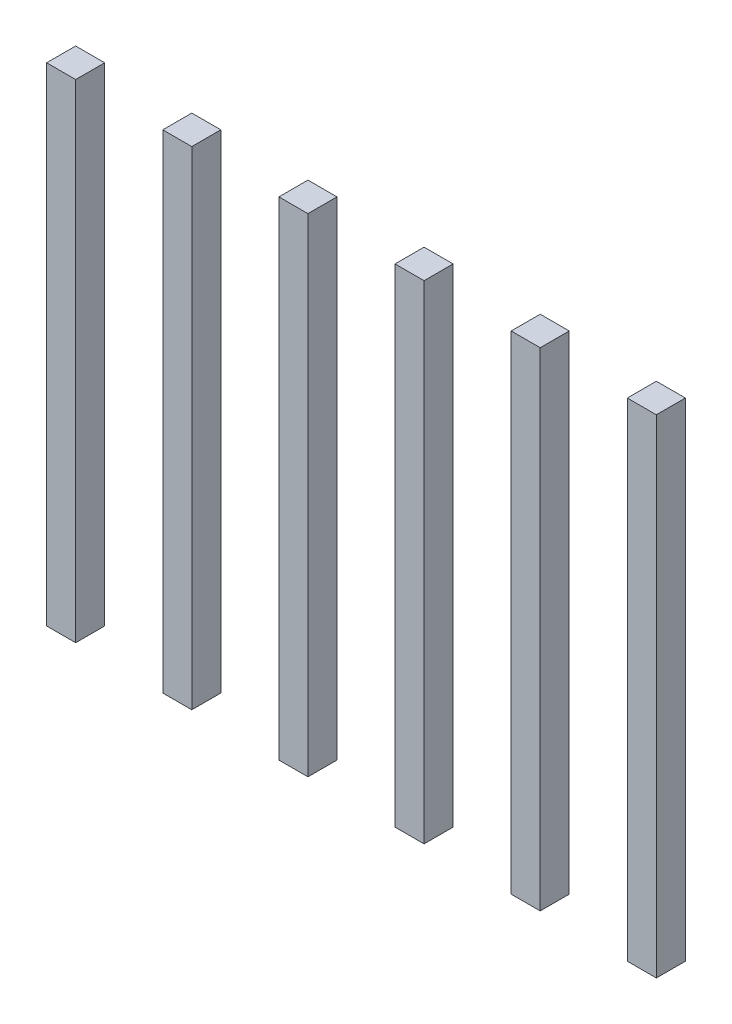
ISO-10303-21;
HEADER;
FILE_DESCRIPTION(('STEP AP214'),'2;1');
FILE_NAME('part.step','',(''),(''),'','','');
FILE_SCHEMA(('AUTOMOTIVE_DESIGN { 1 0 10303 214 1 1 1 1 }'));
ENDSEC;
DATA;
#1=APPLICATION_CONTEXT('core data for automotive mechanical design processes');
#2=APPLICATION_PROTOCOL_DEFINITION('international standard','automotive_design',2000,#1);
#3=PRODUCT_CONTEXT('',#1,'mechanical');
#4=PRODUCT('Part','Part','',(#3));
#5=PRODUCT_RELATED_PRODUCT_CATEGORY('part','',(#4));
#6=PRODUCT_DEFINITION_FORMATION('','',#4);
#7=PRODUCT_DEFINITION_CONTEXT('part definition',#1,'design');
#8=PRODUCT_DEFINITION('design','',#6,#7);
#9=PRODUCT_DEFINITION_SHAPE('','',#8);
#10=(LENGTH_UNIT() NAMED_UNIT(*) SI_UNIT(.MILLI.,.METRE.));
#11=(NAMED_UNIT(*) PLANE_ANGLE_UNIT() SI_UNIT($,.RADIAN.));
#12=(NAMED_UNIT(*) SI_UNIT($,.STERADIAN.) SOLID_ANGLE_UNIT());
#13=UNCERTAINTY_MEASURE_WITH_UNIT(LENGTH_MEASURE(1.E-05),#10,'distance_accuracy_value','');
#14=(GEOMETRIC_REPRESENTATION_CONTEXT(3) GLOBAL_UNCERTAINTY_ASSIGNED_CONTEXT((#13)) GLOBAL_UNIT_ASSIGNED_CONTEXT((#10,
#11,#12)) REPRESENTATION_CONTEXT('',''));
#15=CARTESIAN_POINT('',(0.,0.,0.));
#16=DIRECTION('',(0.,0.,1.));
#17=DIRECTION('',(1.,0.,0.));
#18=AXIS2_PLACEMENT_3D('',#15,#16,#17);
#19=CARTESIAN_POINT('',(10.,5.,-1.8));
#20=DIRECTION('',(0.,1.,0.));
#21=DIRECTION('',(1.,0.,0.));
#22=AXIS2_PLACEMENT_3D('',#19,#20,#21);
#23=PLANE('',#22);
#24=DIRECTION('',(0.,0.,1.));
#25=VECTOR('',#24,1.);
#26=CARTESIAN_POINT('',(9.75,5.,-1.55));
#27=LINE('',#26,#25);
#28=CARTESIAN_POINT('',(9.75,5.,-2.05));
#29=VERTEX_POINT('',#28);
#30=CARTESIAN_POINT('',(9.75,5.,-1.55));
#31=VERTEX_POINT('',#30);
#32=EDGE_CURVE('P0_E11',#29,#31,#27,.T.);
#33=ORIENTED_EDGE('',*,*,#32,.T.);
#34=DIRECTION('',(1.,0.,0.));
#35=VECTOR('',#34,1.);
#36=CARTESIAN_POINT('',(10.25,5.,-1.55));
#37=LINE('',#36,#35);
#38=CARTESIAN_POINT('',(10.25,5.,-1.55));
#39=VERTEX_POINT('',#38);
#40=EDGE_CURVE('P0_E114',#31,#39,#37,.T.);
#41=ORIENTED_EDGE('',*,*,#40,.T.);
#42=DIRECTION('',(0.,0.,-1.));
#43=VECTOR('',#42,1.);
#44=CARTESIAN_POINT('',(10.25,5.,-2.05));
#45=LINE('',#44,#43);
#46=CARTESIAN_POINT('',(10.25,5.,-2.05));
#47=VERTEX_POINT('',#46);
#48=EDGE_CURVE('P0_E102',#39,#47,#45,.T.);
#49=ORIENTED_EDGE('',*,*,#48,.T.);
#50=DIRECTION('',(-1.,0.,0.));
#51=VECTOR('',#50,1.);
#52=CARTESIAN_POINT('',(9.75,5.,-2.05));
#53=LINE('',#52,#51);
#54=EDGE_CURVE('P0_E20',#47,#29,#53,.T.);
#55=ORIENTED_EDGE('',*,*,#54,.T.);
#56=EDGE_LOOP('',(#33,#41,#49,#55));
#57=FACE_BOUND('',#56,.T.);
#58=ADVANCED_FACE('P0_F16',(#57),#23,.T.);
#59=CARTESIAN_POINT('',(9.75,0.,-2.05));
#60=DIRECTION('',(-1.,0.,0.));
#61=DIRECTION('',(0.,0.,1.));
#62=AXIS2_PLACEMENT_3D('',#59,#60,#61);
#63=PLANE('',#62);
#64=DIRECTION('',(0.,1.,0.));
#65=VECTOR('',#64,1.);
#66=CARTESIAN_POINT('',(9.75,0.,-1.55));
#67=LINE('',#66,#65);
#68=CARTESIAN_POINT('',(9.75,-3.4,-1.55));
#69=VERTEX_POINT('',#68);
#70=EDGE_CURVE('P0_E27',#69,#31,#67,.T.);
#71=ORIENTED_EDGE('',*,*,#70,.T.);
#72=ORIENTED_EDGE('',*,*,#32,.F.);
#73=DIRECTION('',(0.,-1.,0.));
#74=VECTOR('',#73,1.);
#75=CARTESIAN_POINT('',(9.75,0.,-2.05));
#76=LINE('',#75,#74);
#77=CARTESIAN_POINT('',(9.75,-3.4,-2.05));
#78=VERTEX_POINT('',#77);
#79=EDGE_CURVE('P0_E72',#29,#78,#76,.T.);
#80=ORIENTED_EDGE('',*,*,#79,.T.);
#81=DIRECTION('',(0.,0.,-1.));
#82=VECTOR('',#81,1.);
#83=CARTESIAN_POINT('',(9.75,-3.4,-1.55));
#84=LINE('',#83,#82);
#85=EDGE_CURVE('P0_E76',#69,#78,#84,.T.);
#86=ORIENTED_EDGE('',*,*,#85,.F.);
#87=EDGE_LOOP('',(#71,#72,#80,#86));
#88=FACE_BOUND('',#87,.T.);
#89=ADVANCED_FACE('P0_F74',(#88),#63,.T.);
#90=CARTESIAN_POINT('',(9.75,0.,-1.55));
#91=DIRECTION('',(0.,0.,1.));
#92=DIRECTION('',(1.,0.,0.));
#93=AXIS2_PLACEMENT_3D('',#90,#91,#92);
#94=PLANE('',#93);
#95=DIRECTION('',(0.,1.,0.));
#96=VECTOR('',#95,1.);
#97=CARTESIAN_POINT('',(10.25,0.,-1.55));
#98=LINE('',#97,#96);
#99=CARTESIAN_POINT('',(10.25,-3.4,-1.55));
#100=VERTEX_POINT('',#99);
#101=EDGE_CURVE('P0_E115',#100,#39,#98,.T.);
#102=ORIENTED_EDGE('',*,*,#101,.T.);
#103=ORIENTED_EDGE('',*,*,#40,.F.);
#104=ORIENTED_EDGE('',*,*,#70,.F.);
#105=DIRECTION('',(-1.,0.,0.));
#106=VECTOR('',#105,1.);
#107=CARTESIAN_POINT('',(10.25,-3.4,-1.55));
#108=LINE('',#107,#106);
#109=EDGE_CURVE('P0_E80',#100,#69,#108,.T.);
#110=ORIENTED_EDGE('',*,*,#109,.F.);
#111=EDGE_LOOP('',(#102,#103,#104,#110));
#112=FACE_BOUND('',#111,.T.);
#113=ADVANCED_FACE('P0_F18',(#112),#94,.T.);
#114=CARTESIAN_POINT('',(10.25,0.,-1.55));
#115=DIRECTION('',(1.,0.,0.));
#116=DIRECTION('',(0.,1.,0.));
#117=AXIS2_PLACEMENT_3D('',#114,#115,#116);
#118=PLANE('',#117);
#119=DIRECTION('',(0.,1.,0.));
#120=VECTOR('',#119,1.);
#121=CARTESIAN_POINT('',(10.25,0.,-2.05));
#122=LINE('',#121,#120);
#123=CARTESIAN_POINT('',(10.25,-3.4,-2.05));
#124=VERTEX_POINT('',#123);
#125=EDGE_CURVE('P0_E86',#124,#47,#122,.T.);
#126=ORIENTED_EDGE('',*,*,#125,.T.);
#127=ORIENTED_EDGE('',*,*,#48,.F.);
#128=ORIENTED_EDGE('',*,*,#101,.F.);
#129=DIRECTION('',(0.,0.,1.));
#130=VECTOR('',#129,1.);
#131=CARTESIAN_POINT('',(10.25,-3.4,-2.05));
#132=LINE('',#131,#130);
#133=EDGE_CURVE('P0_E91',#124,#100,#132,.T.);
#134=ORIENTED_EDGE('',*,*,#133,.F.);
#135=EDGE_LOOP('',(#126,#127,#128,#134));
#136=FACE_BOUND('',#135,.T.);
#137=ADVANCED_FACE('P0_F126',(#136),#118,.T.);
#138=CARTESIAN_POINT('',(10.25,0.,-2.05));
#139=DIRECTION('',(0.,0.,-1.));
#140=DIRECTION('',(0.,-1.,0.));
#141=AXIS2_PLACEMENT_3D('',#138,#139,#140);
#142=PLANE('',#141);
#143=ORIENTED_EDGE('',*,*,#79,.F.);
#144=ORIENTED_EDGE('',*,*,#54,.F.);
#145=ORIENTED_EDGE('',*,*,#125,.F.);
#146=DIRECTION('',(1.,0.,0.));
#147=VECTOR('',#146,1.);
#148=CARTESIAN_POINT('',(9.75,-3.4,-2.05));
#149=LINE('',#148,#147);
#150=EDGE_CURVE('P0_E83',#78,#124,#149,.T.);
#151=ORIENTED_EDGE('',*,*,#150,.F.);
#152=EDGE_LOOP('',(#143,#144,#145,#151));
#153=FACE_BOUND('',#152,.T.);
#154=ADVANCED_FACE('P0_F84',(#153),#142,.T.);
#155=CARTESIAN_POINT('',(10.,-3.4,-1.8));
#156=DIRECTION('',(0.,-1.,0.));
#157=DIRECTION('',(0.,0.,-1.));
#158=AXIS2_PLACEMENT_3D('',#155,#156,#157);
#159=PLANE('',#158);
#160=ORIENTED_EDGE('',*,*,#85,.T.);
#161=ORIENTED_EDGE('',*,*,#150,.T.);
#162=ORIENTED_EDGE('',*,*,#133,.T.);
#163=ORIENTED_EDGE('',*,*,#109,.T.);
#164=EDGE_LOOP('',(#160,#161,#162,#163));
#165=FACE_BOUND('',#164,.T.);
#166=ADVANCED_FACE('P0_F93',(#165),#159,.T.);
#167=CLOSED_SHELL('',(#58,#89,#113,#137,#154,#166));
#168=MANIFOLD_SOLID_BREP('P0_B1',#167);
#169=CARTESIAN_POINT('',(2.,5.,-1.8));
#170=DIRECTION('',(0.,1.,0.));
#171=DIRECTION('',(1.,0.,0.));
#172=AXIS2_PLACEMENT_3D('',#169,#170,#171);
#173=PLANE('',#172);
#174=DIRECTION('',(-1.,0.,0.));
#175=VECTOR('',#174,1.);
#176=CARTESIAN_POINT('',(1.75,5.,-2.05));
#177=LINE('',#176,#175);
#178=CARTESIAN_POINT('',(2.25,5.,-2.05));
#179=VERTEX_POINT('',#178);
#180=CARTESIAN_POINT('',(1.75,5.,-2.05));
#181=VERTEX_POINT('',#180);
#182=EDGE_CURVE('P1_E11',#179,#181,#177,.T.);
#183=ORIENTED_EDGE('',*,*,#182,.T.);
#184=DIRECTION('',(0.,0.,1.));
#185=VECTOR('',#184,1.);
#186=CARTESIAN_POINT('',(1.75,5.,-1.55));
#187=LINE('',#186,#185);
#188=CARTESIAN_POINT('',(1.75,5.,-1.55));
#189=VERTEX_POINT('',#188);
#190=EDGE_CURVE('P1_E78',#181,#189,#187,.T.);
#191=ORIENTED_EDGE('',*,*,#190,.T.);
#192=DIRECTION('',(1.,0.,0.));
#193=VECTOR('',#192,1.);
#194=CARTESIAN_POINT('',(2.25,5.,-1.55));
#195=LINE('',#194,#193);
#196=CARTESIAN_POINT('',(2.25,5.,-1.55));
#197=VERTEX_POINT('',#196);
#198=EDGE_CURVE('P1_E74',#189,#197,#195,.T.);
#199=ORIENTED_EDGE('',*,*,#198,.T.);
#200=DIRECTION('',(0.,0.,-1.));
#201=VECTOR('',#200,1.);
#202=CARTESIAN_POINT('',(2.25,5.,-2.05));
#203=LINE('',#202,#201);
#204=EDGE_CURVE('P1_E107',#197,#179,#203,.T.);
#205=ORIENTED_EDGE('',*,*,#204,.T.);
#206=EDGE_LOOP('',(#183,#191,#199,#205));
#207=FACE_BOUND('',#206,.T.);
#208=ADVANCED_FACE('P1_F16',(#207),#173,.T.);
#209=CARTESIAN_POINT('',(2.25,0.,-2.05));
#210=DIRECTION('',(0.,0.,-1.));
#211=DIRECTION('',(0.,-1.,0.));
#212=AXIS2_PLACEMENT_3D('',#209,#210,#211);
#213=PLANE('',#212);
#214=DIRECTION('',(0.,1.,0.));
#215=VECTOR('',#214,1.);
#216=CARTESIAN_POINT('',(1.75,0.,-2.05));
#217=LINE('',#216,#215);
#218=CARTESIAN_POINT('',(1.75,-3.4,-2.05));
#219=VERTEX_POINT('',#218);
#220=EDGE_CURVE('P1_E20',#219,#181,#217,.T.);
#221=ORIENTED_EDGE('',*,*,#220,.T.);
#222=ORIENTED_EDGE('',*,*,#182,.F.);
#223=DIRECTION('',(0.,-1.,0.));
#224=VECTOR('',#223,1.);
#225=CARTESIAN_POINT('',(2.25,0.,-2.05));
#226=LINE('',#225,#224);
#227=CARTESIAN_POINT('',(2.25,-3.4,-2.05));
#228=VERTEX_POINT('',#227);
#229=EDGE_CURVE('P1_E87',#179,#228,#226,.T.);
#230=ORIENTED_EDGE('',*,*,#229,.T.);
#231=DIRECTION('',(1.,0.,0.));
#232=VECTOR('',#231,1.);
#233=CARTESIAN_POINT('',(1.75,-3.4,-2.05));
#234=LINE('',#233,#232);
#235=EDGE_CURVE('P1_E98',#219,#228,#234,.T.);
#236=ORIENTED_EDGE('',*,*,#235,.F.);
#237=EDGE_LOOP('',(#221,#222,#230,#236));
#238=FACE_BOUND('',#237,.T.);
#239=ADVANCED_FACE('P1_F18',(#238),#213,.T.);
#240=CARTESIAN_POINT('',(1.75,0.,-2.05));
#241=DIRECTION('',(-1.,0.,0.));
#242=DIRECTION('',(0.,0.,1.));
#243=AXIS2_PLACEMENT_3D('',#240,#241,#242);
#244=PLANE('',#243);
#245=DIRECTION('',(0.,1.,0.));
#246=VECTOR('',#245,1.);
#247=CARTESIAN_POINT('',(1.75,0.,-1.55));
#248=LINE('',#247,#246);
#249=CARTESIAN_POINT('',(1.75,-3.4,-1.55));
#250=VERTEX_POINT('',#249);
#251=EDGE_CURVE('P1_E67',#250,#189,#248,.T.);
#252=ORIENTED_EDGE('',*,*,#251,.T.);
#253=ORIENTED_EDGE('',*,*,#190,.F.);
#254=ORIENTED_EDGE('',*,*,#220,.F.);
#255=DIRECTION('',(0.,0.,-1.));
#256=VECTOR('',#255,1.);
#257=CARTESIAN_POINT('',(1.75,-3.4,-1.55));
#258=LINE('',#257,#256);
#259=EDGE_CURVE('P1_E81',#250,#219,#258,.T.);
#260=ORIENTED_EDGE('',*,*,#259,.F.);
#261=EDGE_LOOP('',(#252,#253,#254,#260));
#262=FACE_BOUND('',#261,.T.);
#263=ADVANCED_FACE('P1_F82',(#262),#244,.T.);
#264=CARTESIAN_POINT('',(1.75,0.,-1.55));
#265=DIRECTION('',(0.,0.,1.));
#266=DIRECTION('',(1.,0.,0.));
#267=AXIS2_PLACEMENT_3D('',#264,#265,#266);
#268=PLANE('',#267);
#269=DIRECTION('',(0.,1.,0.));
#270=VECTOR('',#269,1.);
#271=CARTESIAN_POINT('',(2.25,0.,-1.55));
#272=LINE('',#271,#270);
#273=CARTESIAN_POINT('',(2.25,-3.4,-1.55));
#274=VERTEX_POINT('',#273);
#275=EDGE_CURVE('P1_E104',#274,#197,#272,.T.);
#276=ORIENTED_EDGE('',*,*,#275,.T.);
#277=ORIENTED_EDGE('',*,*,#198,.F.);
#278=ORIENTED_EDGE('',*,*,#251,.F.);
#279=DIRECTION('',(-1.,0.,0.));
#280=VECTOR('',#279,1.);
#281=CARTESIAN_POINT('',(2.25,-3.4,-1.55));
#282=LINE('',#281,#280);
#283=EDGE_CURVE('P1_E72',#274,#250,#282,.T.);
#284=ORIENTED_EDGE('',*,*,#283,.F.);
#285=EDGE_LOOP('',(#276,#277,#278,#284));
#286=FACE_BOUND('',#285,.T.);
#287=ADVANCED_FACE('P1_F70',(#286),#268,.T.);
#288=CARTESIAN_POINT('',(2.25,0.,-1.55));
#289=DIRECTION('',(1.,0.,0.));
#290=DIRECTION('',(0.,1.,0.));
#291=AXIS2_PLACEMENT_3D('',#288,#289,#290);
#292=PLANE('',#291);
#293=ORIENTED_EDGE('',*,*,#229,.F.);
#294=ORIENTED_EDGE('',*,*,#204,.F.);
#295=ORIENTED_EDGE('',*,*,#275,.F.);
#296=DIRECTION('',(0.,0.,1.));
#297=VECTOR('',#296,1.);
#298=CARTESIAN_POINT('',(2.25,-3.4,-2.05));
#299=LINE('',#298,#297);
#300=EDGE_CURVE('P1_E91',#228,#274,#299,.T.);
#301=ORIENTED_EDGE('',*,*,#300,.F.);
#302=EDGE_LOOP('',(#293,#294,#295,#301));
#303=FACE_BOUND('',#302,.T.);
#304=ADVANCED_FACE('P1_F116',(#303),#292,.T.);
#305=CARTESIAN_POINT('',(2.,-3.4,-1.8));
#306=DIRECTION('',(0.,-1.,0.));
#307=DIRECTION('',(0.,0.,-1.));
#308=AXIS2_PLACEMENT_3D('',#305,#306,#307);
#309=PLANE('',#308);
#310=ORIENTED_EDGE('',*,*,#235,.T.);
#311=ORIENTED_EDGE('',*,*,#300,.T.);
#312=ORIENTED_EDGE('',*,*,#283,.T.);
#313=ORIENTED_EDGE('',*,*,#259,.T.);
#314=EDGE_LOOP('',(#310,#311,#312,#313));
#315=FACE_BOUND('',#314,.T.);
#316=ADVANCED_FACE('P1_F89',(#315),#309,.T.);
#317=CLOSED_SHELL('',(#208,#239,#263,#287,#304,#316));
#318=MANIFOLD_SOLID_BREP('P1_B1',#317);
#319=CARTESIAN_POINT('',(8.,5.,-1.8));
#320=DIRECTION('',(0.,1.,0.));
#321=DIRECTION('',(1.,0.,0.));
#322=AXIS2_PLACEMENT_3D('',#319,#320,#321);
#323=PLANE('',#322);
#324=DIRECTION('',(0.,0.,1.));
#325=VECTOR('',#324,1.);
#326=CARTESIAN_POINT('',(7.75,5.,-1.55));
#327=LINE('',#326,#325);
#328=CARTESIAN_POINT('',(7.75,5.,-2.05));
#329=VERTEX_POINT('',#328);
#330=CARTESIAN_POINT('',(7.75,5.,-1.55));
#331=VERTEX_POINT('',#330);
#332=EDGE_CURVE('P2_E11',#329,#331,#327,.T.);
#333=ORIENTED_EDGE('',*,*,#332,.T.);
#334=DIRECTION('',(1.,0.,0.));
#335=VECTOR('',#334,1.);
#336=CARTESIAN_POINT('',(8.25,5.,-1.55));
#337=LINE('',#336,#335);
#338=CARTESIAN_POINT('',(8.25,5.,-1.55));
#339=VERTEX_POINT('',#338);
#340=EDGE_CURVE('P2_E79',#331,#339,#337,.T.);
#341=ORIENTED_EDGE('',*,*,#340,.T.);
#342=DIRECTION('',(0.,0.,-1.));
#343=VECTOR('',#342,1.);
#344=CARTESIAN_POINT('',(8.25,5.,-2.05));
#345=LINE('',#344,#343);
#346=CARTESIAN_POINT('',(8.25,5.,-2.05));
#347=VERTEX_POINT('',#346);
#348=EDGE_CURVE('P2_E75',#339,#347,#345,.T.);
#349=ORIENTED_EDGE('',*,*,#348,.T.);
#350=DIRECTION('',(-1.,0.,0.));
#351=VECTOR('',#350,1.);
#352=CARTESIAN_POINT('',(7.75,5.,-2.05));
#353=LINE('',#352,#351);
#354=EDGE_CURVE('P2_E76',#347,#329,#353,.T.);
#355=ORIENTED_EDGE('',*,*,#354,.T.);
#356=EDGE_LOOP('',(#333,#341,#349,#355));
#357=FACE_BOUND('',#356,.T.);
#358=ADVANCED_FACE('P2_F16',(#357),#323,.T.);
#359=CARTESIAN_POINT('',(7.75,0.,-2.05));
#360=DIRECTION('',(-1.,0.,0.));
#361=DIRECTION('',(0.,0.,1.));
#362=AXIS2_PLACEMENT_3D('',#359,#360,#361);
#363=PLANE('',#362);
#364=DIRECTION('',(0.,1.,0.));
#365=VECTOR('',#364,1.);
#366=CARTESIAN_POINT('',(7.75,0.,-1.55));
#367=LINE('',#366,#365);
#368=CARTESIAN_POINT('',(7.75,-3.4,-1.55));
#369=VERTEX_POINT('',#368);
#370=EDGE_CURVE('P2_E26',#369,#331,#367,.T.);
#371=ORIENTED_EDGE('',*,*,#370,.T.);
#372=ORIENTED_EDGE('',*,*,#332,.F.);
#373=DIRECTION('',(0.,-1.,0.));
#374=VECTOR('',#373,1.);
#375=CARTESIAN_POINT('',(7.75,0.,-2.05));
#376=LINE('',#375,#374);
#377=CARTESIAN_POINT('',(7.75,-3.4,-2.05));
#378=VERTEX_POINT('',#377);
#379=EDGE_CURVE('P2_E89',#329,#378,#376,.T.);
#380=ORIENTED_EDGE('',*,*,#379,.T.);
#381=DIRECTION('',(0.,0.,-1.));
#382=VECTOR('',#381,1.);
#383=CARTESIAN_POINT('',(7.75,-3.4,-1.55));
#384=LINE('',#383,#382);
#385=EDGE_CURVE('P2_E105',#369,#378,#384,.T.);
#386=ORIENTED_EDGE('',*,*,#385,.F.);
#387=EDGE_LOOP('',(#371,#372,#380,#386));
#388=FACE_BOUND('',#387,.T.);
#389=ADVANCED_FACE('P2_F114',(#388),#363,.T.);
#390=CARTESIAN_POINT('',(7.75,0.,-1.55));
#391=DIRECTION('',(0.,0.,1.));
#392=DIRECTION('',(1.,0.,0.));
#393=AXIS2_PLACEMENT_3D('',#390,#391,#392);
#394=PLANE('',#393);
#395=DIRECTION('',(0.,1.,0.));
#396=VECTOR('',#395,1.);
#397=CARTESIAN_POINT('',(8.25,0.,-1.55));
#398=LINE('',#397,#396);
#399=CARTESIAN_POINT('',(8.25,-3.4,-1.55));
#400=VERTEX_POINT('',#399);
#401=EDGE_CURVE('P2_E19',#400,#339,#398,.T.);
#402=ORIENTED_EDGE('',*,*,#401,.T.);
#403=ORIENTED_EDGE('',*,*,#340,.F.);
#404=ORIENTED_EDGE('',*,*,#370,.F.);
#405=DIRECTION('',(-1.,0.,0.));
#406=VECTOR('',#405,1.);
#407=CARTESIAN_POINT('',(8.25,-3.4,-1.55));
#408=LINE('',#407,#406);
#409=EDGE_CURVE('P2_E96',#400,#369,#408,.T.);
#410=ORIENTED_EDGE('',*,*,#409,.F.);
#411=EDGE_LOOP('',(#402,#403,#404,#410));
#412=FACE_BOUND('',#411,.T.);
#413=ADVANCED_FACE('P2_F116',(#412),#394,.T.);
#414=CARTESIAN_POINT('',(8.25,0.,-1.55));
#415=DIRECTION('',(1.,0.,0.));
#416=DIRECTION('',(0.,1.,0.));
#417=AXIS2_PLACEMENT_3D('',#414,#415,#416);
#418=PLANE('',#417);
#419=DIRECTION('',(0.,1.,0.));
#420=VECTOR('',#419,1.);
#421=CARTESIAN_POINT('',(8.25,0.,-2.05));
#422=LINE('',#421,#420);
#423=CARTESIAN_POINT('',(8.25,-3.4,-2.05));
#424=VERTEX_POINT('',#423);
#425=EDGE_CURVE('P2_E57',#424,#347,#422,.T.);
#426=ORIENTED_EDGE('',*,*,#425,.T.);
#427=ORIENTED_EDGE('',*,*,#348,.F.);
#428=ORIENTED_EDGE('',*,*,#401,.F.);
#429=DIRECTION('',(0.,0.,1.));
#430=VECTOR('',#429,1.);
#431=CARTESIAN_POINT('',(8.25,-3.4,-2.05));
#432=LINE('',#431,#430);
#433=EDGE_CURVE('P2_E84',#424,#400,#432,.T.);
#434=ORIENTED_EDGE('',*,*,#433,.F.);
#435=EDGE_LOOP('',(#426,#427,#428,#434));
#436=FACE_BOUND('',#435,.T.);
#437=ADVANCED_FACE('P2_F82',(#436),#418,.T.);
#438=CARTESIAN_POINT('',(8.25,0.,-2.05));
#439=DIRECTION('',(0.,0.,-1.));
#440=DIRECTION('',(0.,-1.,0.));
#441=AXIS2_PLACEMENT_3D('',#438,#439,#440);
#442=PLANE('',#441);
#443=ORIENTED_EDGE('',*,*,#379,.F.);
#444=ORIENTED_EDGE('',*,*,#354,.F.);
#445=ORIENTED_EDGE('',*,*,#425,.F.);
#446=DIRECTION('',(1.,0.,0.));
#447=VECTOR('',#446,1.);
#448=CARTESIAN_POINT('',(7.75,-3.4,-2.05));
#449=LINE('',#448,#447);
#450=EDGE_CURVE('P2_E108',#378,#424,#449,.T.);
#451=ORIENTED_EDGE('',*,*,#450,.F.);
#452=EDGE_LOOP('',(#443,#444,#445,#451));
#453=FACE_BOUND('',#452,.T.);
#454=ADVANCED_FACE('P2_F88',(#453),#442,.T.);
#455=CARTESIAN_POINT('',(8.,-3.4,-1.8));
#456=DIRECTION('',(0.,-1.,0.));
#457=DIRECTION('',(0.,0.,-1.));
#458=AXIS2_PLACEMENT_3D('',#455,#456,#457);
#459=PLANE('',#458);
#460=ORIENTED_EDGE('',*,*,#385,.T.);
#461=ORIENTED_EDGE('',*,*,#450,.T.);
#462=ORIENTED_EDGE('',*,*,#433,.T.);
#463=ORIENTED_EDGE('',*,*,#409,.T.);
#464=EDGE_LOOP('',(#460,#461,#462,#463));
#465=FACE_BOUND('',#464,.T.);
#466=ADVANCED_FACE('P2_F154',(#465),#459,.T.);
#467=CLOSED_SHELL('',(#358,#389,#413,#437,#454,#466));
#468=MANIFOLD_SOLID_BREP('P2_B1',#467);
#469=CARTESIAN_POINT('',(12.,5.,-1.8));
#470=DIRECTION('',(0.,1.,0.));
#471=DIRECTION('',(1.,0.,0.));
#472=AXIS2_PLACEMENT_3D('',#469,#470,#471);
#473=PLANE('',#472);
#474=DIRECTION('',(0.,0.,1.));
#475=VECTOR('',#474,1.);
#476=CARTESIAN_POINT('',(11.75,5.,-1.55));
#477=LINE('',#476,#475);
#478=CARTESIAN_POINT('',(11.75,5.,-2.05));
#479=VERTEX_POINT('',#478);
#480=CARTESIAN_POINT('',(11.75,5.,-1.55));
#481=VERTEX_POINT('',#480);
#482=EDGE_CURVE('P3_E11',#479,#481,#477,.T.);
#483=ORIENTED_EDGE('',*,*,#482,.T.);
#484=DIRECTION('',(1.,0.,0.));
#485=VECTOR('',#484,1.);
#486=CARTESIAN_POINT('',(12.25,5.,-1.55));
#487=LINE('',#486,#485);
#488=CARTESIAN_POINT('',(12.25,5.,-1.55));
#489=VERTEX_POINT('',#488);
#490=EDGE_CURVE('P3_E81',#481,#489,#487,.T.);
#491=ORIENTED_EDGE('',*,*,#490,.T.);
#492=DIRECTION('',(0.,0.,-1.));
#493=VECTOR('',#492,1.);
#494=CARTESIAN_POINT('',(12.25,5.,-2.05));
#495=LINE('',#494,#493);
#496=CARTESIAN_POINT('',(12.25,5.,-2.05));
#497=VERTEX_POINT('',#496);
#498=EDGE_CURVE('P3_E77',#489,#497,#495,.T.);
#499=ORIENTED_EDGE('',*,*,#498,.T.);
#500=DIRECTION('',(-1.,0.,0.));
#501=VECTOR('',#500,1.);
#502=CARTESIAN_POINT('',(11.75,5.,-2.05));
#503=LINE('',#502,#501);
#504=EDGE_CURVE('P3_E103',#497,#479,#503,.T.);
#505=ORIENTED_EDGE('',*,*,#504,.T.);
#506=EDGE_LOOP('',(#483,#491,#499,#505));
#507=FACE_BOUND('',#506,.T.);
#508=ADVANCED_FACE('P3_F16',(#507),#473,.T.);
#509=CARTESIAN_POINT('',(11.75,0.,-2.05));
#510=DIRECTION('',(-1.,0.,0.));
#511=DIRECTION('',(0.,0.,1.));
#512=AXIS2_PLACEMENT_3D('',#509,#510,#511);
#513=PLANE('',#512);
#514=DIRECTION('',(0.,1.,0.));
#515=VECTOR('',#514,1.);
#516=CARTESIAN_POINT('',(11.75,0.,-1.55));
#517=LINE('',#516,#515);
#518=CARTESIAN_POINT('',(11.75,-3.4,-1.55));
#519=VERTEX_POINT('',#518);
#520=EDGE_CURVE('P3_E27',#519,#481,#517,.T.);
#521=ORIENTED_EDGE('',*,*,#520,.T.);
#522=ORIENTED_EDGE('',*,*,#482,.F.);
#523=DIRECTION('',(0.,-1.,0.));
#524=VECTOR('',#523,1.);
#525=CARTESIAN_POINT('',(11.75,0.,-2.05));
#526=LINE('',#525,#524);
#527=CARTESIAN_POINT('',(11.75,-3.4,-2.05));
#528=VERTEX_POINT('',#527);
#529=EDGE_CURVE('P3_E89',#479,#528,#526,.T.);
#530=ORIENTED_EDGE('',*,*,#529,.T.);
#531=DIRECTION('',(0.,0.,-1.));
#532=VECTOR('',#531,1.);
#533=CARTESIAN_POINT('',(11.75,-3.4,-1.55));
#534=LINE('',#533,#532);
#535=EDGE_CURVE('P3_E99',#519,#528,#534,.T.);
#536=ORIENTED_EDGE('',*,*,#535,.F.);
#537=EDGE_LOOP('',(#521,#522,#530,#536));
#538=FACE_BOUND('',#537,.T.);
#539=ADVANCED_FACE('P3_F118',(#538),#513,.T.);
#540=CARTESIAN_POINT('',(11.75,0.,-1.55));
#541=DIRECTION('',(0.,0.,1.));
#542=DIRECTION('',(1.,0.,0.));
#543=AXIS2_PLACEMENT_3D('',#540,#541,#542);
#544=PLANE('',#543);
#545=DIRECTION('',(0.,1.,0.));
#546=VECTOR('',#545,1.);
#547=CARTESIAN_POINT('',(12.25,0.,-1.55));
#548=LINE('',#547,#546);
#549=CARTESIAN_POINT('',(12.25,-3.4,-1.55));
#550=VERTEX_POINT('',#549);
#551=EDGE_CURVE('P3_E70',#550,#489,#548,.T.);
#552=ORIENTED_EDGE('',*,*,#551,.T.);
#553=ORIENTED_EDGE('',*,*,#490,.F.);
#554=ORIENTED_EDGE('',*,*,#520,.F.);
#555=DIRECTION('',(-1.,0.,0.));
#556=VECTOR('',#555,1.);
#557=CARTESIAN_POINT('',(12.25,-3.4,-1.55));
#558=LINE('',#557,#556);
#559=EDGE_CURVE('P3_E20',#550,#519,#558,.T.);
#560=ORIENTED_EDGE('',*,*,#559,.F.);
#561=EDGE_LOOP('',(#552,#553,#554,#560));
#562=FACE_BOUND('',#561,.T.);
#563=ADVANCED_FACE('P3_F84',(#562),#544,.T.);
#564=CARTESIAN_POINT('',(12.25,0.,-1.55));
#565=DIRECTION('',(1.,0.,0.));
#566=DIRECTION('',(0.,1.,0.));
#567=AXIS2_PLACEMENT_3D('',#564,#565,#566);
#568=PLANE('',#567);
#569=DIRECTION('',(0.,1.,0.));
#570=VECTOR('',#569,1.);
#571=CARTESIAN_POINT('',(12.25,0.,-2.05));
#572=LINE('',#571,#570);
#573=CARTESIAN_POINT('',(12.25,-3.4,-2.05));
#574=VERTEX_POINT('',#573);
#575=EDGE_CURVE('P3_E106',#574,#497,#572,.T.);
#576=ORIENTED_EDGE('',*,*,#575,.T.);
#577=ORIENTED_EDGE('',*,*,#498,.F.);
#578=ORIENTED_EDGE('',*,*,#551,.F.);
#579=DIRECTION('',(0.,0.,1.));
#580=VECTOR('',#579,1.);
#581=CARTESIAN_POINT('',(12.25,-3.4,-2.05));
#582=LINE('',#581,#580);
#583=EDGE_CURVE('P3_E75',#574,#550,#582,.T.);
#584=ORIENTED_EDGE('',*,*,#583,.F.);
#585=EDGE_LOOP('',(#576,#577,#578,#584));
#586=FACE_BOUND('',#585,.T.);
#587=ADVANCED_FACE('P3_F73',(#586),#568,.T.);
#588=CARTESIAN_POINT('',(12.25,0.,-2.05));
#589=DIRECTION('',(0.,0.,-1.));
#590=DIRECTION('',(0.,-1.,0.));
#591=AXIS2_PLACEMENT_3D('',#588,#589,#590);
#592=PLANE('',#591);
#593=ORIENTED_EDGE('',*,*,#529,.F.);
#594=ORIENTED_EDGE('',*,*,#504,.F.);
#595=ORIENTED_EDGE('',*,*,#575,.F.);
#596=DIRECTION('',(1.,0.,0.));
#597=VECTOR('',#596,1.);
#598=CARTESIAN_POINT('',(11.75,-3.4,-2.05));
#599=LINE('',#598,#597);
#600=EDGE_CURVE('P3_E92',#528,#574,#599,.T.);
#601=ORIENTED_EDGE('',*,*,#600,.F.);
#602=EDGE_LOOP('',(#593,#594,#595,#601));
#603=FACE_BOUND('',#602,.T.);
#604=ADVANCED_FACE('P3_F18',(#603),#592,.T.);
#605=CARTESIAN_POINT('',(12.,-3.4,-1.8));
#606=DIRECTION('',(0.,-1.,0.));
#607=DIRECTION('',(0.,0.,-1.));
#608=AXIS2_PLACEMENT_3D('',#605,#606,#607);
#609=PLANE('',#608);
#610=ORIENTED_EDGE('',*,*,#535,.T.);
#611=ORIENTED_EDGE('',*,*,#600,.T.);
#612=ORIENTED_EDGE('',*,*,#583,.T.);
#613=ORIENTED_EDGE('',*,*,#559,.T.);
#614=EDGE_LOOP('',(#610,#611,#612,#613));
#615=FACE_BOUND('',#614,.T.);
#616=ADVANCED_FACE('P3_F90',(#615),#609,.T.);
#617=CLOSED_SHELL('',(#508,#539,#563,#587,#604,#616));
#618=MANIFOLD_SOLID_BREP('P3_B1',#617);
#619=CARTESIAN_POINT('',(4.,5.,-1.8));
#620=DIRECTION('',(0.,1.,0.));
#621=DIRECTION('',(1.,0.,0.));
#622=AXIS2_PLACEMENT_3D('',#619,#620,#621);
#623=PLANE('',#622);
#624=DIRECTION('',(0.,0.,1.));
#625=VECTOR('',#624,1.);
#626=CARTESIAN_POINT('',(3.75,5.,-1.55));
#627=LINE('',#626,#625);
#628=CARTESIAN_POINT('',(3.75,5.,-2.05));
#629=VERTEX_POINT('',#628);
#630=CARTESIAN_POINT('',(3.75,5.,-1.55));
#631=VERTEX_POINT('',#630);
#632=EDGE_CURVE('P4_E11',#629,#631,#627,.T.);
#633=ORIENTED_EDGE('',*,*,#632,.T.);
#634=DIRECTION('',(1.,0.,0.));
#635=VECTOR('',#634,1.);
#636=CARTESIAN_POINT('',(4.25,5.,-1.55));
#637=LINE('',#636,#635);
#638=CARTESIAN_POINT('',(4.25,5.,-1.55));
#639=VERTEX_POINT('',#638);
#640=EDGE_CURVE('P4_E75',#631,#639,#637,.T.);
#641=ORIENTED_EDGE('',*,*,#640,.T.);
#642=DIRECTION('',(0.,0.,-1.));
#643=VECTOR('',#642,1.);
#644=CARTESIAN_POINT('',(4.25,5.,-2.05));
#645=LINE('',#644,#643);
#646=CARTESIAN_POINT('',(4.25,5.,-2.05));
#647=VERTEX_POINT('',#646);
#648=EDGE_CURVE('P4_E100',#639,#647,#645,.T.);
#649=ORIENTED_EDGE('',*,*,#648,.T.);
#650=DIRECTION('',(-1.,0.,0.));
#651=VECTOR('',#650,1.);
#652=CARTESIAN_POINT('',(3.75,5.,-2.05));
#653=LINE('',#652,#651);
#654=EDGE_CURVE('P4_E20',#647,#629,#653,.T.);
#655=ORIENTED_EDGE('',*,*,#654,.T.);
#656=EDGE_LOOP('',(#633,#641,#649,#655));
#657=FACE_BOUND('',#656,.T.);
#658=ADVANCED_FACE('P4_F16',(#657),#623,.T.);
#659=CARTESIAN_POINT('',(3.75,0.,-2.05));
#660=DIRECTION('',(-1.,0.,0.));
#661=DIRECTION('',(0.,0.,1.));
#662=AXIS2_PLACEMENT_3D('',#659,#660,#661);
#663=PLANE('',#662);
#664=DIRECTION('',(0.,1.,0.));
#665=VECTOR('',#664,1.);
#666=CARTESIAN_POINT('',(3.75,0.,-1.55));
#667=LINE('',#666,#665);
#668=CARTESIAN_POINT('',(3.75,-3.4,-1.55));
#669=VERTEX_POINT('',#668);
#670=EDGE_CURVE('P4_E27',#669,#631,#667,.T.);
#671=ORIENTED_EDGE('',*,*,#670,.T.);
#672=ORIENTED_EDGE('',*,*,#632,.F.);
#673=DIRECTION('',(0.,-1.,0.));
#674=VECTOR('',#673,1.);
#675=CARTESIAN_POINT('',(3.75,0.,-2.05));
#676=LINE('',#675,#674);
#677=CARTESIAN_POINT('',(3.75,-3.4,-2.05));
#678=VERTEX_POINT('',#677);
#679=EDGE_CURVE('P4_E63',#629,#678,#676,.T.);
#680=ORIENTED_EDGE('',*,*,#679,.T.);
#681=DIRECTION('',(0.,0.,-1.));
#682=VECTOR('',#681,1.);
#683=CARTESIAN_POINT('',(3.75,-3.4,-1.55));
#684=LINE('',#683,#682);
#685=EDGE_CURVE('P4_E82',#669,#678,#684,.T.);
#686=ORIENTED_EDGE('',*,*,#685,.F.);
#687=EDGE_LOOP('',(#671,#672,#680,#686));
#688=FACE_BOUND('',#687,.T.);
#689=ADVANCED_FACE('P4_F87',(#688),#663,.T.);
#690=CARTESIAN_POINT('',(3.75,0.,-1.55));
#691=DIRECTION('',(0.,0.,1.));
#692=DIRECTION('',(1.,0.,0.));
#693=AXIS2_PLACEMENT_3D('',#690,#691,#692);
#694=PLANE('',#693);
#695=DIRECTION('',(0.,1.,0.));
#696=VECTOR('',#695,1.);
#697=CARTESIAN_POINT('',(4.25,0.,-1.55));
#698=LINE('',#697,#696);
#699=CARTESIAN_POINT('',(4.25,-3.4,-1.55));
#700=VERTEX_POINT('',#699);
#701=EDGE_CURVE('P4_E97',#700,#639,#698,.T.);
#702=ORIENTED_EDGE('',*,*,#701,.T.);
#703=ORIENTED_EDGE('',*,*,#640,.F.);
#704=ORIENTED_EDGE('',*,*,#670,.F.);
#705=DIRECTION('',(-1.,0.,0.));
#706=VECTOR('',#705,1.);
#707=CARTESIAN_POINT('',(4.25,-3.4,-1.55));
#708=LINE('',#707,#706);
#709=EDGE_CURVE('P4_E73',#700,#669,#708,.T.);
#710=ORIENTED_EDGE('',*,*,#709,.F.);
#711=EDGE_LOOP('',(#702,#703,#704,#710));
#712=FACE_BOUND('',#711,.T.);
#713=ADVANCED_FACE('P4_F18',(#712),#694,.T.);
#714=CARTESIAN_POINT('',(4.25,0.,-1.55));
#715=DIRECTION('',(1.,0.,0.));
#716=DIRECTION('',(0.,1.,0.));
#717=AXIS2_PLACEMENT_3D('',#714,#715,#716);
#718=PLANE('',#717);
#719=DIRECTION('',(0.,1.,0.));
#720=VECTOR('',#719,1.);
#721=CARTESIAN_POINT('',(4.25,0.,-2.05));
#722=LINE('',#721,#720);
#723=CARTESIAN_POINT('',(4.25,-3.4,-2.05));
#724=VERTEX_POINT('',#723);
#725=EDGE_CURVE('P4_E109',#724,#647,#722,.T.);
#726=ORIENTED_EDGE('',*,*,#725,.T.);
#727=ORIENTED_EDGE('',*,*,#648,.F.);
#728=ORIENTED_EDGE('',*,*,#701,.F.);
#729=DIRECTION('',(0.,0.,1.));
#730=VECTOR('',#729,1.);
#731=CARTESIAN_POINT('',(4.25,-3.4,-2.05));
#732=LINE('',#731,#730);
#733=EDGE_CURVE('P4_E84',#724,#700,#732,.T.);
#734=ORIENTED_EDGE('',*,*,#733,.F.);
#735=EDGE_LOOP('',(#726,#727,#728,#734));
#736=FACE_BOUND('',#735,.T.);
#737=ADVANCED_FACE('P4_F122',(#736),#718,.T.);
#738=CARTESIAN_POINT('',(4.25,0.,-2.05));
#739=DIRECTION('',(0.,0.,-1.));
#740=DIRECTION('',(0.,-1.,0.));
#741=AXIS2_PLACEMENT_3D('',#738,#739,#740);
#742=PLANE('',#741);
#743=ORIENTED_EDGE('',*,*,#679,.F.);
#744=ORIENTED_EDGE('',*,*,#654,.F.);
#745=ORIENTED_EDGE('',*,*,#725,.F.);
#746=DIRECTION('',(1.,0.,0.));
#747=VECTOR('',#746,1.);
#748=CARTESIAN_POINT('',(3.75,-3.4,-2.05));
#749=LINE('',#748,#747);
#750=EDGE_CURVE('P4_E89',#678,#724,#749,.T.);
#751=ORIENTED_EDGE('',*,*,#750,.F.);
#752=EDGE_LOOP('',(#743,#744,#745,#751));
#753=FACE_BOUND('',#752,.T.);
#754=ADVANCED_FACE('P4_F121',(#753),#742,.T.);
#755=CARTESIAN_POINT('',(4.,-3.4,-1.8));
#756=DIRECTION('',(0.,-1.,0.));
#757=DIRECTION('',(0.,0.,-1.));
#758=AXIS2_PLACEMENT_3D('',#755,#756,#757);
#759=PLANE('',#758);
#760=ORIENTED_EDGE('',*,*,#685,.T.);
#761=ORIENTED_EDGE('',*,*,#750,.T.);
#762=ORIENTED_EDGE('',*,*,#733,.T.);
#763=ORIENTED_EDGE('',*,*,#709,.T.);
#764=EDGE_LOOP('',(#760,#761,#762,#763));
#765=FACE_BOUND('',#764,.T.);
#766=ADVANCED_FACE('P4_F80',(#765),#759,.T.);
#767=CLOSED_SHELL('',(#658,#689,#713,#737,#754,#766));
#768=MANIFOLD_SOLID_BREP('P4_B1',#767);
#769=CARTESIAN_POINT('',(6.,5.,-1.8));
#770=DIRECTION('',(0.,1.,0.));
#771=DIRECTION('',(1.,0.,0.));
#772=AXIS2_PLACEMENT_3D('',#769,#770,#771);
#773=PLANE('',#772);
#774=DIRECTION('',(0.,0.,1.));
#775=VECTOR('',#774,1.);
#776=CARTESIAN_POINT('',(5.75,5.,-1.55));
#777=LINE('',#776,#775);
#778=CARTESIAN_POINT('',(5.75,5.,-2.05));
#779=VERTEX_POINT('',#778);
#780=CARTESIAN_POINT('',(5.75,5.,-1.55));
#781=VERTEX_POINT('',#780);
#782=EDGE_CURVE('P5_E11',#779,#781,#777,.T.);
#783=ORIENTED_EDGE('',*,*,#782,.T.);
#784=DIRECTION('',(1.,0.,0.));
#785=VECTOR('',#784,1.);
#786=CARTESIAN_POINT('',(6.25,5.,-1.55));
#787=LINE('',#786,#785);
#788=CARTESIAN_POINT('',(6.25,5.,-1.55));
#789=VERTEX_POINT('',#788);
#790=EDGE_CURVE('P5_E74',#781,#789,#787,.T.);
#791=ORIENTED_EDGE('',*,*,#790,.T.);
#792=DIRECTION('',(0.,0.,-1.));
#793=VECTOR('',#792,1.);
#794=CARTESIAN_POINT('',(6.25,5.,-2.05));
#795=LINE('',#794,#793);
#796=CARTESIAN_POINT('',(6.25,5.,-2.05));
#797=VERTEX_POINT('',#796);
#798=EDGE_CURVE('P5_E63',#789,#797,#795,.T.);
#799=ORIENTED_EDGE('',*,*,#798,.T.);
#800=DIRECTION('',(-1.,0.,0.));
#801=VECTOR('',#800,1.);
#802=CARTESIAN_POINT('',(5.75,5.,-2.05));
#803=LINE('',#802,#801);
#804=EDGE_CURVE('P5_E108',#797,#779,#803,.T.);
#805=ORIENTED_EDGE('',*,*,#804,.T.);
#806=EDGE_LOOP('',(#783,#791,#799,#805));
#807=FACE_BOUND('',#806,.T.);
#808=ADVANCED_FACE('P5_F16',(#807),#773,.T.);
#809=CARTESIAN_POINT('',(5.75,0.,-2.05));
#810=DIRECTION('',(-1.,0.,0.));
#811=DIRECTION('',(0.,0.,1.));
#812=AXIS2_PLACEMENT_3D('',#809,#810,#811);
#813=PLANE('',#812);
#814=DIRECTION('',(0.,1.,0.));
#815=VECTOR('',#814,1.);
#816=CARTESIAN_POINT('',(5.75,0.,-1.55));
#817=LINE('',#816,#815);
#818=CARTESIAN_POINT('',(5.75,-3.4,-1.55));
#819=VERTEX_POINT('',#818);
#820=EDGE_CURVE('P5_E27',#819,#781,#817,.T.);
#821=ORIENTED_EDGE('',*,*,#820,.T.);
#822=ORIENTED_EDGE('',*,*,#782,.F.);
#823=DIRECTION('',(0.,-1.,0.));
#824=VECTOR('',#823,1.);
#825=CARTESIAN_POINT('',(5.75,0.,-2.05));
#826=LINE('',#825,#824);
#827=CARTESIAN_POINT('',(5.75,-3.4,-2.05));
#828=VERTEX_POINT('',#827);
#829=EDGE_CURVE('P5_E86',#779,#828,#826,.T.);
#830=ORIENTED_EDGE('',*,*,#829,.T.);
#831=DIRECTION('',(0.,0.,-1.));
#832=VECTOR('',#831,1.);
#833=CARTESIAN_POINT('',(5.75,-3.4,-1.55));
#834=LINE('',#833,#832);
#835=EDGE_CURVE('P5_E82',#819,#828,#834,.T.);
#836=ORIENTED_EDGE('',*,*,#835,.F.);
#837=EDGE_LOOP('',(#821,#822,#830,#836));
#838=FACE_BOUND('',#837,.T.);
#839=ADVANCED_FACE('P5_F87',(#838),#813,.T.);
#840=CARTESIAN_POINT('',(5.75,0.,-1.55));
#841=DIRECTION('',(0.,0.,1.));
#842=DIRECTION('',(1.,0.,0.));
#843=AXIS2_PLACEMENT_3D('',#840,#841,#842);
#844=PLANE('',#843);
#845=DIRECTION('',(0.,1.,0.));
#846=VECTOR('',#845,1.);
#847=CARTESIAN_POINT('',(6.25,0.,-1.55));
#848=LINE('',#847,#846);
#849=CARTESIAN_POINT('',(6.25,-3.4,-1.55));
#850=VERTEX_POINT('',#849);
#851=EDGE_CURVE('P5_E101',#850,#789,#848,.T.);
#852=ORIENTED_EDGE('',*,*,#851,.T.);
#853=ORIENTED_EDGE('',*,*,#790,.F.);
#854=ORIENTED_EDGE('',*,*,#820,.F.);
#855=DIRECTION('',(-1.,0.,0.));
#856=VECTOR('',#855,1.);
#857=CARTESIAN_POINT('',(6.25,-3.4,-1.55));
#858=LINE('',#857,#856);
#859=EDGE_CURVE('P5_E20',#850,#819,#858,.T.);
#860=ORIENTED_EDGE('',*,*,#859,.F.);
#861=EDGE_LOOP('',(#852,#853,#854,#860));
#862=FACE_BOUND('',#861,.T.);
#863=ADVANCED_FACE('P5_F72',(#862),#844,.T.);
#864=CARTESIAN_POINT('',(6.25,0.,-1.55));
#865=DIRECTION('',(1.,0.,0.));
#866=DIRECTION('',(0.,1.,0.));
#867=AXIS2_PLACEMENT_3D('',#864,#865,#866);
#868=PLANE('',#867);
#869=DIRECTION('',(0.,1.,0.));
#870=VECTOR('',#869,1.);
#871=CARTESIAN_POINT('',(6.25,0.,-2.05));
#872=LINE('',#871,#870);
#873=CARTESIAN_POINT('',(6.25,-3.4,-2.05));
#874=VERTEX_POINT('',#873);
#875=EDGE_CURVE('P5_E102',#874,#797,#872,.T.);
#876=ORIENTED_EDGE('',*,*,#875,.T.);
#877=ORIENTED_EDGE('',*,*,#798,.F.);
#878=ORIENTED_EDGE('',*,*,#851,.F.);
#879=DIRECTION('',(0.,0.,1.));
#880=VECTOR('',#879,1.);
#881=CARTESIAN_POINT('',(6.25,-3.4,-2.05));
#882=LINE('',#881,#880);
#883=EDGE_CURVE('P5_E84',#874,#850,#882,.T.);
#884=ORIENTED_EDGE('',*,*,#883,.F.);
#885=EDGE_LOOP('',(#876,#877,#878,#884));
#886=FACE_BOUND('',#885,.T.);
#887=ADVANCED_FACE('P5_F18',(#886),#868,.T.);
#888=CARTESIAN_POINT('',(6.25,0.,-2.05));
#889=DIRECTION('',(0.,0.,-1.));
#890=DIRECTION('',(0.,-1.,0.));
#891=AXIS2_PLACEMENT_3D('',#888,#889,#890);
#892=PLANE('',#891);
#893=ORIENTED_EDGE('',*,*,#829,.F.);
#894=ORIENTED_EDGE('',*,*,#804,.F.);
#895=ORIENTED_EDGE('',*,*,#875,.F.);
#896=DIRECTION('',(1.,0.,0.));
#897=VECTOR('',#896,1.);
#898=CARTESIAN_POINT('',(5.75,-3.4,-2.05));
#899=LINE('',#898,#897);
#900=EDGE_CURVE('P5_E91',#828,#874,#899,.T.);
#901=ORIENTED_EDGE('',*,*,#900,.F.);
#902=EDGE_LOOP('',(#893,#894,#895,#901));
#903=FACE_BOUND('',#902,.T.);
#904=ADVANCED_FACE('P5_F162',(#903),#892,.T.);
#905=CARTESIAN_POINT('',(6.,-3.4,-1.8));
#906=DIRECTION('',(0.,-1.,0.));
#907=DIRECTION('',(0.,0.,-1.));
#908=AXIS2_PLACEMENT_3D('',#905,#906,#907);
#909=PLANE('',#908);
#910=ORIENTED_EDGE('',*,*,#835,.T.);
#911=ORIENTED_EDGE('',*,*,#900,.T.);
#912=ORIENTED_EDGE('',*,*,#883,.T.);
#913=ORIENTED_EDGE('',*,*,#859,.T.);
#914=EDGE_LOOP('',(#910,#911,#912,#913));
#915=FACE_BOUND('',#914,.T.);
#916=ADVANCED_FACE('P5_F80',(#915),#909,.T.);
#917=CLOSED_SHELL('',(#808,#839,#863,#887,#904,#916));
#918=MANIFOLD_SOLID_BREP('P5_B1',#917);
#919=ADVANCED_BREP_SHAPE_REPRESENTATION('',(#18,#168,#318,#468,#618,#768,#918),#14);
#920=SHAPE_DEFINITION_REPRESENTATION(#9,#919);
ENDSEC;
END-ISO-10303-21;
